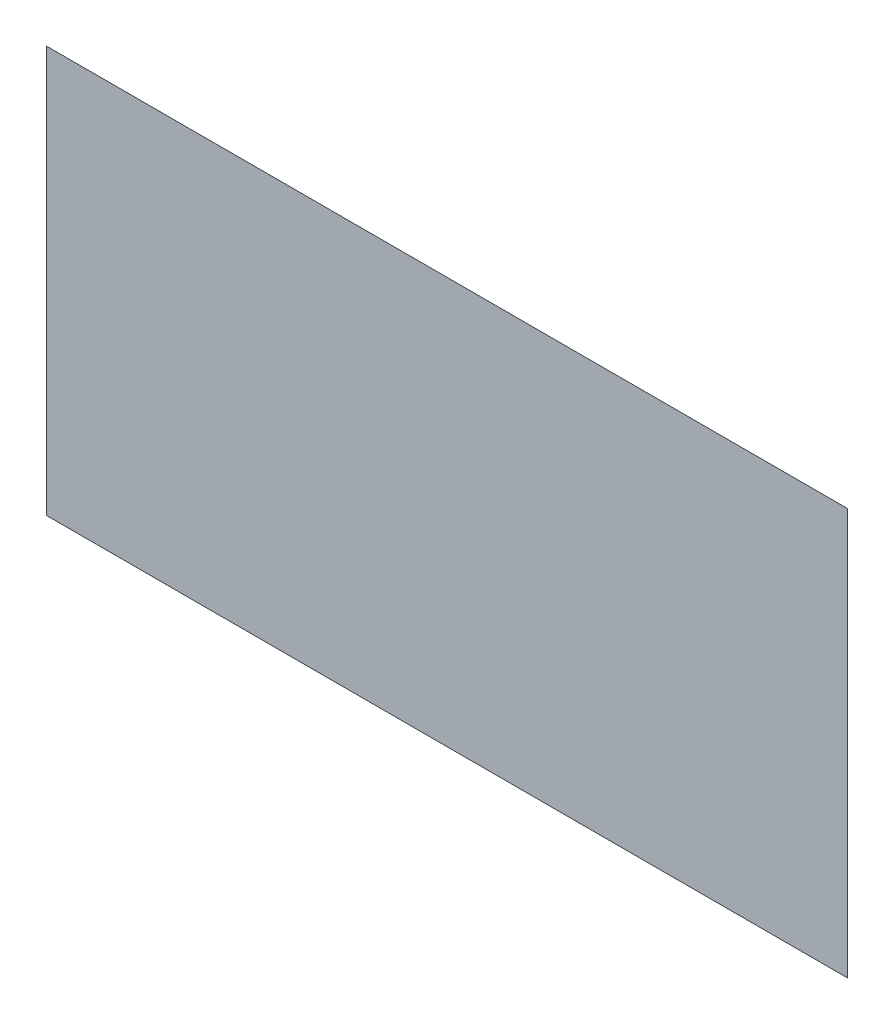
ISO-10303-21;
HEADER;
FILE_DESCRIPTION(('STEP AP214'),'2;1');
FILE_NAME('part.step','',(''),(''),'','','');
FILE_SCHEMA(('AUTOMOTIVE_DESIGN { 1 0 10303 214 1 1 1 1 }'));
ENDSEC;
DATA;
#1=APPLICATION_CONTEXT('core data for automotive mechanical design processes');
#2=APPLICATION_PROTOCOL_DEFINITION('international standard','automotive_design',2000,#1);
#3=PRODUCT_CONTEXT('',#1,'mechanical');
#4=PRODUCT('Part','Part','',(#3));
#5=PRODUCT_RELATED_PRODUCT_CATEGORY('part','',(#4));
#6=PRODUCT_DEFINITION_FORMATION('','',#4);
#7=PRODUCT_DEFINITION_CONTEXT('part definition',#1,'design');
#8=PRODUCT_DEFINITION('design','',#6,#7);
#9=PRODUCT_DEFINITION_SHAPE('','',#8);
#10=(LENGTH_UNIT() NAMED_UNIT(*) SI_UNIT(.MILLI.,.METRE.));
#11=(NAMED_UNIT(*) PLANE_ANGLE_UNIT() SI_UNIT($,.RADIAN.));
#12=(NAMED_UNIT(*) SI_UNIT($,.STERADIAN.) SOLID_ANGLE_UNIT());
#13=UNCERTAINTY_MEASURE_WITH_UNIT(LENGTH_MEASURE(1.E-05),#10,'distance_accuracy_value','');
#14=(GEOMETRIC_REPRESENTATION_CONTEXT(3) GLOBAL_UNCERTAINTY_ASSIGNED_CONTEXT((#13)) GLOBAL_UNIT_ASSIGNED_CONTEXT((#10,
#11,#12)) REPRESENTATION_CONTEXT('',''));
#15=CARTESIAN_POINT('',(0.,0.,0.));
#16=DIRECTION('',(0.,0.,1.));
#17=DIRECTION('',(1.,0.,0.));
#18=AXIS2_PLACEMENT_3D('',#15,#16,#17);
#19=CARTESIAN_POINT('',(6.11196058812,0.899254942831,0.001668));
#20=DIRECTION('',(0.,0.,1.));
#21=DIRECTION('',(1.,0.,0.));
#22=AXIS2_PLACEMENT_3D('',#19,#20,#21);
#23=PLANE('',#22);
#24=CARTESIAN_POINT('',(6.083179879326,0.913856299492,0.001668));
#25=DIRECTION('',(0.,-1.,0.));
#26=VECTOR('',#25,1.);
#27=LINE('',#24,#26);
#28=CARTESIAN_POINT('',(6.083179879326,0.913856299492,0.0015));
#29=VERTEX_POINT('',#28);
#30=CARTESIAN_POINT('',(6.083179879326,0.88465358617,0.0015));
#31=VERTEX_POINT('',#30);
#32=EDGE_CURVE('E41',#29,#31,#27,.T.);
#33=ORIENTED_EDGE('',*,*,#32,.T.);
#34=CARTESIAN_POINT('',(6.083179879326,0.88465358617,0.001668));
#35=DIRECTION('',(1.,0.,0.));
#36=VECTOR('',#35,1.);
#37=LINE('',#34,#36);
#38=CARTESIAN_POINT('',(6.140741296913,0.88465358617,0.0015));
#39=VERTEX_POINT('',#38);
#40=EDGE_CURVE('E28',#31,#39,#37,.T.);
#41=ORIENTED_EDGE('',*,*,#40,.T.);
#42=CARTESIAN_POINT('',(6.140741296913,0.88465358617,0.001668));
#43=DIRECTION('',(0.,1.,0.));
#44=VECTOR('',#43,1.);
#45=LINE('',#42,#44);
#46=CARTESIAN_POINT('',(6.140741296913,0.913856299492,0.0015));
#47=VERTEX_POINT('',#46);
#48=EDGE_CURVE('E11',#39,#47,#45,.T.);
#49=ORIENTED_EDGE('',*,*,#48,.T.);
#50=CARTESIAN_POINT('',(6.140741296913,0.913856299492,0.001668));
#51=DIRECTION('',(-1.,0.,0.));
#52=VECTOR('',#51,1.);
#53=LINE('',#50,#52);
#54=EDGE_CURVE('E44',#47,#29,#53,.T.);
#55=ORIENTED_EDGE('',*,*,#54,.T.);
#56=EDGE_LOOP('',(#33,#41,#49,#55));
#57=FACE_BOUND('',#56,.T.);
#58=ADVANCED_FACE('F17',(#57),#23,.T.);
#59=CARTESIAN_POINT('',(6.11196058812,0.899254942831,0.001332));
#60=DIRECTION('',(0.,0.,1.));
#61=DIRECTION('',(1.,0.,0.));
#62=AXIS2_PLACEMENT_3D('',#59,#60,#61);
#63=PLANE('',#62);
#64=ORIENTED_EDGE('',*,*,#40,.F.);
#65=ORIENTED_EDGE('',*,*,#32,.F.);
#66=ORIENTED_EDGE('',*,*,#54,.F.);
#67=ORIENTED_EDGE('',*,*,#48,.F.);
#68=EDGE_LOOP('',(#64,#65,#66,#67));
#69=FACE_BOUND('',#68,.T.);
#70=ADVANCED_FACE('F46',(#69),#63,.F.);
#71=CLOSED_SHELL('',(#58,#70));
#72=MANIFOLD_SOLID_BREP('B1',#71);
#73=ADVANCED_BREP_SHAPE_REPRESENTATION('',(#18,#72),#14);
#74=SHAPE_DEFINITION_REPRESENTATION(#9,#73);
ENDSEC;
END-ISO-10303-21;
